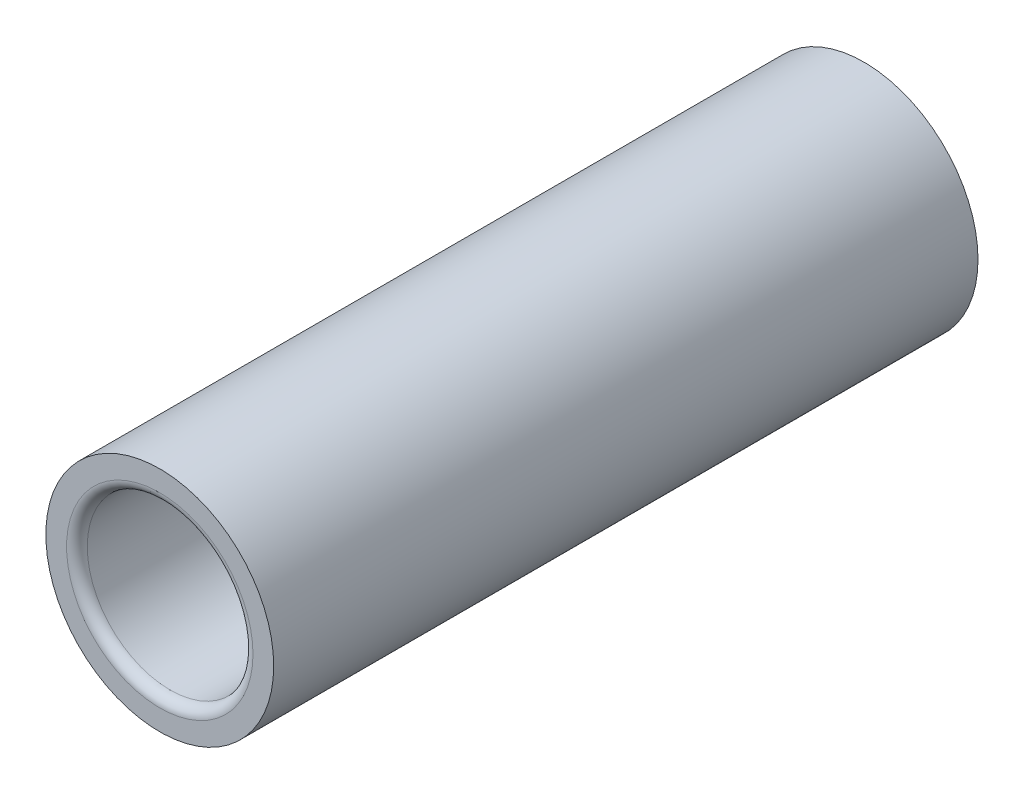
ISO-10303-21;
HEADER;
FILE_DESCRIPTION(('STEP AP214'),'2;1');
FILE_NAME('part.step','',(''),(''),'','','');
FILE_SCHEMA(('AUTOMOTIVE_DESIGN { 1 0 10303 214 1 1 1 1 }'));
ENDSEC;
DATA;
#1=APPLICATION_CONTEXT('core data for automotive mechanical design processes');
#2=APPLICATION_PROTOCOL_DEFINITION('international standard','automotive_design',2000,#1);
#3=PRODUCT_CONTEXT('',#1,'mechanical');
#4=PRODUCT('Part','Part','',(#3));
#5=PRODUCT_RELATED_PRODUCT_CATEGORY('part','',(#4));
#6=PRODUCT_DEFINITION_FORMATION('','',#4);
#7=PRODUCT_DEFINITION_CONTEXT('part definition',#1,'design');
#8=PRODUCT_DEFINITION('design','',#6,#7);
#9=PRODUCT_DEFINITION_SHAPE('','',#8);
#10=(LENGTH_UNIT() NAMED_UNIT(*) SI_UNIT(.MILLI.,.METRE.));
#11=(NAMED_UNIT(*) PLANE_ANGLE_UNIT() SI_UNIT($,.RADIAN.));
#12=(NAMED_UNIT(*) SI_UNIT($,.STERADIAN.) SOLID_ANGLE_UNIT());
#13=UNCERTAINTY_MEASURE_WITH_UNIT(LENGTH_MEASURE(1.E-05),#10,'distance_accuracy_value','');
#14=(GEOMETRIC_REPRESENTATION_CONTEXT(3) GLOBAL_UNCERTAINTY_ASSIGNED_CONTEXT((#13)) GLOBAL_UNIT_ASSIGNED_CONTEXT((#10,
#11,#12)) REPRESENTATION_CONTEXT('',''));
#15=CARTESIAN_POINT('',(0.,0.,0.));
#16=DIRECTION('',(0.,0.,1.));
#17=DIRECTION('',(1.,0.,0.));
#18=AXIS2_PLACEMENT_3D('',#15,#16,#17);
#19=CARTESIAN_POINT('',(0.,0.,34.));
#20=DIRECTION('',(0.,0.,1.));
#21=DIRECTION('',(1.,0.,0.));
#22=AXIS2_PLACEMENT_3D('',#19,#20,#21);
#23=PLANE('',#22);
#24=CARTESIAN_POINT('',(0.,0.,34.));
#25=DIRECTION('',(0.,0.,1.));
#26=DIRECTION('',(1.,0.,0.));
#27=AXIS2_PLACEMENT_3D('',#24,#25,#26);
#28=CIRCLE('',#27,9.);
#29=CARTESIAN_POINT('',(9.,0.,34.));
#30=VERTEX_POINT('',#29);
#31=EDGE_CURVE('E10',#30,#30,#28,.F.);
#32=ORIENTED_EDGE('',*,*,#31,.T.);
#33=EDGE_LOOP('',(#32));
#34=FACE_BOUND('',#33,.T.);
#35=CARTESIAN_POINT('',(0.,0.,34.));
#36=DIRECTION('',(0.,0.,1.));
#37=DIRECTION('',(1.,0.,0.));
#38=AXIS2_PLACEMENT_3D('',#35,#36,#37);
#39=CIRCLE('',#38,11.);
#40=CARTESIAN_POINT('',(11.,0.,34.));
#41=VERTEX_POINT('',#40);
#42=EDGE_CURVE('E65',#41,#41,#39,.T.);
#43=ORIENTED_EDGE('',*,*,#42,.T.);
#44=EDGE_LOOP('',(#43));
#45=FACE_BOUND('',#44,.T.);
#46=ADVANCED_FACE('F41',(#34,#45),#23,.T.);
#47=CARTESIAN_POINT('',(0.,0.,-34.));
#48=DIRECTION('',(0.,0.,1.));
#49=DIRECTION('',(1.,0.,0.));
#50=AXIS2_PLACEMENT_3D('',#47,#48,#49);
#51=PLANE('',#50);
#52=CARTESIAN_POINT('',(0.,0.,-34.));
#53=DIRECTION('',(0.,0.,1.));
#54=DIRECTION('',(1.,0.,0.));
#55=AXIS2_PLACEMENT_3D('',#52,#53,#54);
#56=CIRCLE('',#55,9.);
#57=CARTESIAN_POINT('',(9.,0.,-34.));
#58=VERTEX_POINT('',#57);
#59=EDGE_CURVE('E59',#58,#58,#56,.T.);
#60=ORIENTED_EDGE('',*,*,#59,.T.);
#61=EDGE_LOOP('',(#60));
#62=FACE_BOUND('',#61,.T.);
#63=CARTESIAN_POINT('',(0.,0.,-34.));
#64=DIRECTION('',(0.,0.,1.));
#65=DIRECTION('',(1.,0.,0.));
#66=AXIS2_PLACEMENT_3D('',#63,#64,#65);
#67=CIRCLE('',#66,11.);
#68=CARTESIAN_POINT('',(11.,0.,-34.));
#69=VERTEX_POINT('',#68);
#70=EDGE_CURVE('E66',#69,#69,#67,.T.);
#71=ORIENTED_EDGE('',*,*,#70,.F.);
#72=EDGE_LOOP('',(#71));
#73=FACE_BOUND('',#72,.T.);
#74=ADVANCED_FACE('F79',(#62,#73),#51,.F.);
#75=CARTESIAN_POINT('',(0.,0.,34.));
#76=DIRECTION('',(0.,0.,-1.));
#77=DIRECTION('',(-1.,0.,0.));
#78=AXIS2_PLACEMENT_3D('',#75,#76,#77);
#79=CYLINDRICAL_SURFACE('',#78,11.);
#80=ORIENTED_EDGE('',*,*,#42,.F.);
#81=EDGE_LOOP('',(#80));
#82=FACE_BOUND('',#81,.T.);
#83=ORIENTED_EDGE('',*,*,#70,.T.);
#84=EDGE_LOOP('',(#83));
#85=FACE_BOUND('',#84,.T.);
#86=ADVANCED_FACE('F75',(#82,#85),#79,.T.);
#87=CARTESIAN_POINT('',(0.,0.,34.));
#88=DIRECTION('',(0.,0.,-1.));
#89=DIRECTION('',(-1.,0.,0.));
#90=AXIS2_PLACEMENT_3D('',#87,#88,#89);
#91=CYLINDRICAL_SURFACE('',#90,8.);
#92=CARTESIAN_POINT('',(0.,0.,-33.));
#93=DIRECTION('',(0.,0.,1.));
#94=DIRECTION('',(1.,0.,0.));
#95=AXIS2_PLACEMENT_3D('',#92,#93,#94);
#96=CIRCLE('',#95,8.);
#97=CARTESIAN_POINT('',(8.,0.,-33.));
#98=VERTEX_POINT('',#97);
#99=EDGE_CURVE('E49',#98,#98,#96,.F.);
#100=ORIENTED_EDGE('',*,*,#99,.T.);
#101=EDGE_LOOP('',(#100));
#102=FACE_BOUND('',#101,.T.);
#103=CARTESIAN_POINT('',(0.,0.,33.));
#104=DIRECTION('',(0.,0.,1.));
#105=DIRECTION('',(1.,0.,0.));
#106=AXIS2_PLACEMENT_3D('',#103,#104,#105);
#107=CIRCLE('',#106,8.);
#108=CARTESIAN_POINT('',(8.,0.,33.));
#109=VERTEX_POINT('',#108);
#110=EDGE_CURVE('E54',#109,#109,#107,.T.);
#111=ORIENTED_EDGE('',*,*,#110,.T.);
#112=EDGE_LOOP('',(#111));
#113=FACE_BOUND('',#112,.T.);
#114=ADVANCED_FACE('F78',(#102,#113),#91,.F.);
#115=CARTESIAN_POINT('',(0.,0.,-33.));
#116=DIRECTION('',(0.,0.,1.));
#117=DIRECTION('',(1.,0.,0.));
#118=AXIS2_PLACEMENT_3D('',#115,#116,#117);
#119=TOROIDAL_SURFACE('',#118,9.,1.);
#120=ORIENTED_EDGE('',*,*,#99,.F.);
#121=EDGE_LOOP('',(#120));
#122=FACE_BOUND('',#121,.T.);
#123=ORIENTED_EDGE('',*,*,#59,.F.);
#124=EDGE_LOOP('',(#123));
#125=FACE_BOUND('',#124,.T.);
#126=ADVANCED_FACE('F91',(#122,#125),#119,.T.);
#127=CARTESIAN_POINT('',(0.,0.,33.));
#128=DIRECTION('',(0.,0.,1.));
#129=DIRECTION('',(1.,0.,0.));
#130=AXIS2_PLACEMENT_3D('',#127,#128,#129);
#131=TOROIDAL_SURFACE('',#130,9.,1.);
#132=ORIENTED_EDGE('',*,*,#31,.F.);
#133=EDGE_LOOP('',(#132));
#134=FACE_BOUND('',#133,.T.);
#135=ORIENTED_EDGE('',*,*,#110,.F.);
#136=EDGE_LOOP('',(#135));
#137=FACE_BOUND('',#136,.T.);
#138=ADVANCED_FACE('F43',(#134,#137),#131,.T.);
#139=CLOSED_SHELL('',(#46,#74,#86,#114,#126,#138));
#140=MANIFOLD_SOLID_BREP('B2',#139);
#141=ADVANCED_BREP_SHAPE_REPRESENTATION('',(#18,#140),#14);
#142=SHAPE_DEFINITION_REPRESENTATION(#9,#141);
ENDSEC;
END-ISO-10303-21;
